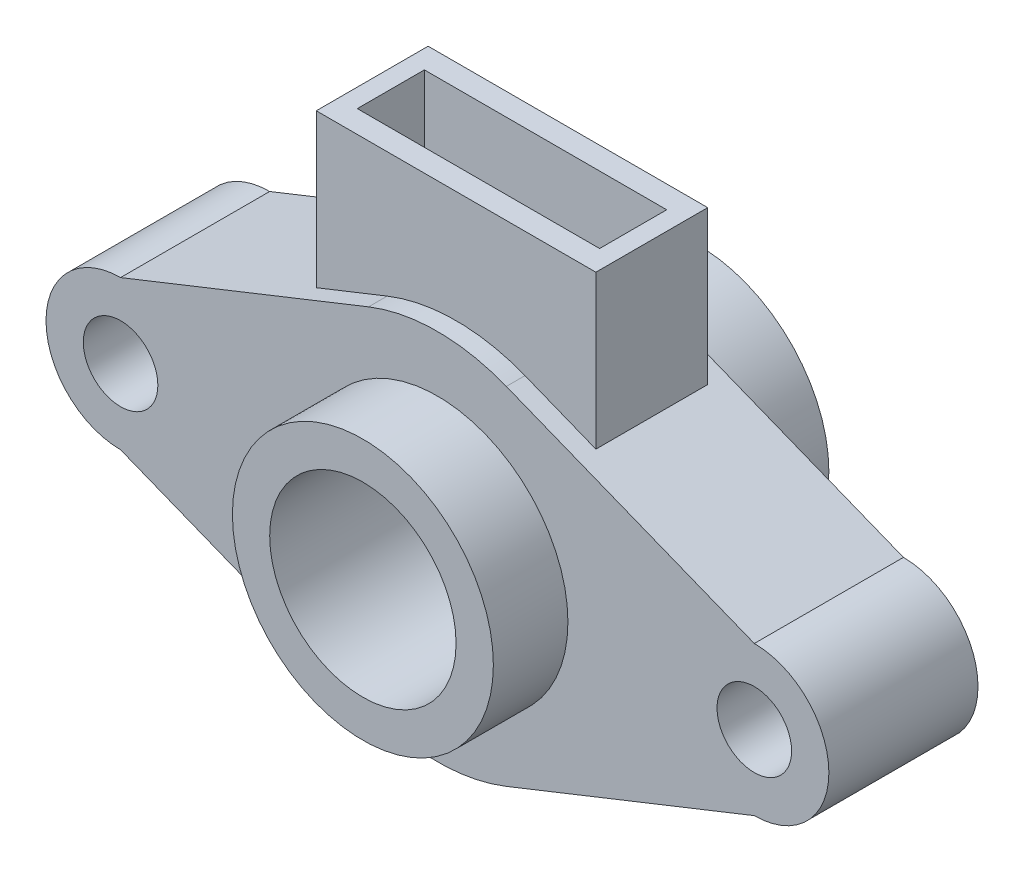
ISO-10303-21;
HEADER;
FILE_DESCRIPTION(('STEP AP214'),'2;1');
FILE_NAME('part.step','',(''),(''),'','','');
FILE_SCHEMA(('AUTOMOTIVE_DESIGN { 1 0 10303 214 1 1 1 1 }'));
ENDSEC;
DATA;
#1=APPLICATION_CONTEXT('core data for automotive mechanical design processes');
#2=APPLICATION_PROTOCOL_DEFINITION('international standard','automotive_design',2000,#1);
#3=PRODUCT_CONTEXT('',#1,'mechanical');
#4=PRODUCT('Part','Part','',(#3));
#5=PRODUCT_RELATED_PRODUCT_CATEGORY('part','',(#4));
#6=PRODUCT_DEFINITION_FORMATION('','',#4);
#7=PRODUCT_DEFINITION_CONTEXT('part definition',#1,'design');
#8=PRODUCT_DEFINITION('design','',#6,#7);
#9=PRODUCT_DEFINITION_SHAPE('','',#8);
#10=(LENGTH_UNIT() NAMED_UNIT(*) SI_UNIT(.MILLI.,.METRE.));
#11=(NAMED_UNIT(*) PLANE_ANGLE_UNIT() SI_UNIT($,.RADIAN.));
#12=(NAMED_UNIT(*) SI_UNIT($,.STERADIAN.) SOLID_ANGLE_UNIT());
#13=UNCERTAINTY_MEASURE_WITH_UNIT(LENGTH_MEASURE(1.E-05),#10,'distance_accuracy_value','');
#14=(GEOMETRIC_REPRESENTATION_CONTEXT(3) GLOBAL_UNCERTAINTY_ASSIGNED_CONTEXT((#13)) GLOBAL_UNIT_ASSIGNED_CONTEXT((#10,
#11,#12)) REPRESENTATION_CONTEXT('',''));
#15=CARTESIAN_POINT('',(0.,0.,0.));
#16=DIRECTION('',(0.,0.,1.));
#17=DIRECTION('',(1.,0.,0.));
#18=AXIS2_PLACEMENT_3D('',#15,#16,#17);
#19=CARTESIAN_POINT('',(0.,0.,20.));
#20=DIRECTION('',(0.,0.,-1.));
#21=DIRECTION('',(-1.,0.,0.));
#22=AXIS2_PLACEMENT_3D('',#19,#20,#21);
#23=CYLINDRICAL_SURFACE('',#22,50.);
#24=DIRECTION('',(0.,0.,-1.));
#25=VECTOR('',#24,1.);
#26=CARTESIAN_POINT('',(-18.4801173355565,46.4595013238849,20.));
#27=LINE('',#26,#25);
#28=CARTESIAN_POINT('',(-18.4801173355565,46.4595013238849,-15.));
#29=VERTEX_POINT('',#28);
#30=CARTESIAN_POINT('',(-18.4801173355565,46.4595013238849,-20.));
#31=VERTEX_POINT('',#30);
#32=EDGE_CURVE('E290',#29,#31,#27,.T.);
#33=ORIENTED_EDGE('',*,*,#32,.F.);
#34=CARTESIAN_POINT('',(0.,0.,-15.));
#35=DIRECTION('',(0.,0.,-1.));
#36=DIRECTION('',(-1.,0.,0.));
#37=AXIS2_PLACEMENT_3D('',#34,#35,#36);
#38=CIRCLE('',#37,50.);
#39=CARTESIAN_POINT('',(18.4801173355565,46.4595013238849,-15.));
#40=VERTEX_POINT('',#39);
#41=EDGE_CURVE('E199',#40,#29,#38,.F.);
#42=ORIENTED_EDGE('',*,*,#41,.F.);
#43=DIRECTION('',(0.,0.,-1.));
#44=VECTOR('',#43,1.);
#45=CARTESIAN_POINT('',(18.4801173355565,46.4595013238849,20.));
#46=LINE('',#45,#44);
#47=CARTESIAN_POINT('',(18.4801173355565,46.4595013238849,-20.));
#48=VERTEX_POINT('',#47);
#49=EDGE_CURVE('E294',#40,#48,#46,.T.);
#50=ORIENTED_EDGE('',*,*,#49,.T.);
#51=CARTESIAN_POINT('',(0.,0.,-20.));
#52=DIRECTION('',(0.,0.,1.));
#53=DIRECTION('',(1.,0.,0.));
#54=AXIS2_PLACEMENT_3D('',#51,#52,#53);
#55=CIRCLE('',#54,50.);
#56=EDGE_CURVE('E284',#48,#31,#55,.T.);
#57=ORIENTED_EDGE('',*,*,#56,.T.);
#58=EDGE_LOOP('',(#33,#42,#50,#57));
#59=FACE_BOUND('',#58,.T.);
#60=ADVANCED_FACE('F33',(#59),#23,.T.);
#61=CARTESIAN_POINT('',(-85.,0.,20.));
#62=DIRECTION('',(0.,0.,1.));
#63=DIRECTION('',(1.,0.,0.));
#64=AXIS2_PLACEMENT_3D('',#61,#62,#63);
#65=PLANE('',#64);
#66=CARTESIAN_POINT('',(0.,0.,20.));
#67=DIRECTION('',(0.,0.,1.));
#68=DIRECTION('',(1.,0.,0.));
#69=AXIS2_PLACEMENT_3D('',#66,#67,#68);
#70=CIRCLE('',#69,35.);
#71=CARTESIAN_POINT('',(35.,0.,20.));
#72=VERTEX_POINT('',#71);
#73=EDGE_CURVE('E233',#72,#72,#70,.T.);
#74=ORIENTED_EDGE('',*,*,#73,.F.);
#75=EDGE_LOOP('',(#74));
#76=FACE_BOUND('',#75,.T.);
#77=CARTESIAN_POINT('',(-85.,0.,20.));
#78=DIRECTION('',(0.,0.,1.));
#79=DIRECTION('',(1.,0.,0.));
#80=AXIS2_PLACEMENT_3D('',#77,#78,#79);
#81=CIRCLE('',#80,10.);
#82=CARTESIAN_POINT('',(-75.,0.,20.));
#83=VERTEX_POINT('',#82);
#84=EDGE_CURVE('E246',#83,#83,#81,.T.);
#85=ORIENTED_EDGE('',*,*,#84,.F.);
#86=EDGE_LOOP('',(#85));
#87=FACE_BOUND('',#86,.T.);
#88=CARTESIAN_POINT('',(-85.,0.,20.));
#89=DIRECTION('',(0.,0.,1.));
#90=DIRECTION('',(1.,0.,0.));
#91=AXIS2_PLACEMENT_3D('',#88,#89,#90);
#92=CIRCLE('',#91,20.);
#93=CARTESIAN_POINT('',(-85.,20.,20.));
#94=VERTEX_POINT('',#93);
#95=CARTESIAN_POINT('',(-85.,-20.,20.));
#96=VERTEX_POINT('',#95);
#97=EDGE_CURVE('E252',#94,#96,#92,.T.);
#98=ORIENTED_EDGE('',*,*,#97,.T.);
#99=DIRECTION('',(0.929190026477698,-0.36960234671113,0.));
#100=VECTOR('',#99,1.);
#101=CARTESIAN_POINT('',(-85.,-20.,20.));
#102=LINE('',#101,#100);
#103=CARTESIAN_POINT('',(-18.4801173355565,-46.4595013238849,20.));
#104=VERTEX_POINT('',#103);
#105=EDGE_CURVE('E255',#96,#104,#102,.T.);
#106=ORIENTED_EDGE('',*,*,#105,.T.);
#107=CARTESIAN_POINT('',(0.,0.,20.));
#108=DIRECTION('',(0.,0.,1.));
#109=DIRECTION('',(1.,0.,0.));
#110=AXIS2_PLACEMENT_3D('',#107,#108,#109);
#111=CIRCLE('',#110,50.);
#112=CARTESIAN_POINT('',(18.4801173355565,-46.4595013238849,20.));
#113=VERTEX_POINT('',#112);
#114=EDGE_CURVE('E258',#104,#113,#111,.T.);
#115=ORIENTED_EDGE('',*,*,#114,.T.);
#116=DIRECTION('',(0.929190026477698,0.36960234671113,0.));
#117=VECTOR('',#116,1.);
#118=CARTESIAN_POINT('',(85.,-20.,20.));
#119=LINE('',#118,#117);
#120=CARTESIAN_POINT('',(85.,-20.,20.));
#121=VERTEX_POINT('',#120);
#122=EDGE_CURVE('E260',#113,#121,#119,.T.);
#123=ORIENTED_EDGE('',*,*,#122,.T.);
#124=CARTESIAN_POINT('',(85.,0.,20.));
#125=DIRECTION('',(0.,0.,1.));
#126=DIRECTION('',(1.,0.,0.));
#127=AXIS2_PLACEMENT_3D('',#124,#125,#126);
#128=CIRCLE('',#127,20.);
#129=CARTESIAN_POINT('',(85.,20.,20.));
#130=VERTEX_POINT('',#129);
#131=EDGE_CURVE('E262',#121,#130,#128,.T.);
#132=ORIENTED_EDGE('',*,*,#131,.T.);
#133=DIRECTION('',(-0.929190026477698,0.36960234671113,0.));
#134=VECTOR('',#133,1.);
#135=CARTESIAN_POINT('',(85.,20.,20.));
#136=LINE('',#135,#134);
#137=CARTESIAN_POINT('',(18.4801173355565,46.4595013238849,20.));
#138=VERTEX_POINT('',#137);
#139=EDGE_CURVE('E264',#130,#138,#136,.T.);
#140=ORIENTED_EDGE('',*,*,#139,.T.);
#141=CARTESIAN_POINT('',(0.,0.,20.));
#142=DIRECTION('',(0.,0.,1.));
#143=DIRECTION('',(1.,0.,0.));
#144=AXIS2_PLACEMENT_3D('',#141,#142,#143);
#145=CIRCLE('',#144,50.);
#146=CARTESIAN_POINT('',(-18.4801173355565,46.4595013238849,20.));
#147=VERTEX_POINT('',#146);
#148=EDGE_CURVE('E266',#138,#147,#145,.T.);
#149=ORIENTED_EDGE('',*,*,#148,.T.);
#150=DIRECTION('',(-0.929190026477698,-0.36960234671113,0.));
#151=VECTOR('',#150,1.);
#152=CARTESIAN_POINT('',(-85.,20.,20.));
#153=LINE('',#152,#151);
#154=EDGE_CURVE('E268',#147,#94,#153,.T.);
#155=ORIENTED_EDGE('',*,*,#154,.T.);
#156=EDGE_LOOP('',(#98,#106,#115,#123,#132,#140,#149,#155));
#157=FACE_BOUND('',#156,.T.);
#158=CARTESIAN_POINT('',(85.,0.,20.));
#159=DIRECTION('',(0.,0.,1.));
#160=DIRECTION('',(1.,0.,0.));
#161=AXIS2_PLACEMENT_3D('',#158,#159,#160);
#162=CIRCLE('',#161,10.);
#163=CARTESIAN_POINT('',(95.,0.,20.));
#164=VERTEX_POINT('',#163);
#165=EDGE_CURVE('E240',#164,#164,#162,.T.);
#166=ORIENTED_EDGE('',*,*,#165,.F.);
#167=EDGE_LOOP('',(#166));
#168=FACE_BOUND('',#167,.T.);
#169=ADVANCED_FACE('F343',(#76,#87,#157,#168),#65,.T.);
#170=CARTESIAN_POINT('',(-85.,0.,-20.));
#171=DIRECTION('',(0.,0.,1.));
#172=DIRECTION('',(1.,0.,0.));
#173=AXIS2_PLACEMENT_3D('',#170,#171,#172);
#174=PLANE('',#173);
#175=CARTESIAN_POINT('',(0.,0.,-20.));
#176=DIRECTION('',(0.,0.,1.));
#177=DIRECTION('',(1.,0.,0.));
#178=AXIS2_PLACEMENT_3D('',#175,#176,#177);
#179=CIRCLE('',#178,35.);
#180=CARTESIAN_POINT('',(35.,0.,-20.));
#181=VERTEX_POINT('',#180);
#182=EDGE_CURVE('E313',#181,#181,#179,.F.);
#183=ORIENTED_EDGE('',*,*,#182,.F.);
#184=EDGE_LOOP('',(#183));
#185=FACE_BOUND('',#184,.T.);
#186=CARTESIAN_POINT('',(-85.,0.,-20.));
#187=DIRECTION('',(0.,0.,1.));
#188=DIRECTION('',(1.,0.,0.));
#189=AXIS2_PLACEMENT_3D('',#186,#187,#188);
#190=CIRCLE('',#189,20.);
#191=CARTESIAN_POINT('',(-85.,20.,-20.));
#192=VERTEX_POINT('',#191);
#193=CARTESIAN_POINT('',(-85.,-20.,-20.));
#194=VERTEX_POINT('',#193);
#195=EDGE_CURVE('E249',#192,#194,#190,.T.);
#196=ORIENTED_EDGE('',*,*,#195,.F.);
#197=DIRECTION('',(-0.929190026477698,-0.36960234671113,0.));
#198=VECTOR('',#197,1.);
#199=CARTESIAN_POINT('',(-85.,20.,-20.));
#200=LINE('',#199,#198);
#201=EDGE_CURVE('E256',#31,#192,#200,.T.);
#202=ORIENTED_EDGE('',*,*,#201,.F.);
#203=ORIENTED_EDGE('',*,*,#56,.F.);
#204=DIRECTION('',(-0.929190026477698,0.36960234671113,0.));
#205=VECTOR('',#204,1.);
#206=CARTESIAN_POINT('',(85.,20.,-20.));
#207=LINE('',#206,#205);
#208=CARTESIAN_POINT('',(85.,20.,-20.));
#209=VERTEX_POINT('',#208);
#210=EDGE_CURVE('E281',#209,#48,#207,.T.);
#211=ORIENTED_EDGE('',*,*,#210,.F.);
#212=CARTESIAN_POINT('',(85.,0.,-20.));
#213=DIRECTION('',(0.,0.,1.));
#214=DIRECTION('',(1.,0.,0.));
#215=AXIS2_PLACEMENT_3D('',#212,#213,#214);
#216=CIRCLE('',#215,20.);
#217=CARTESIAN_POINT('',(85.,-20.,-20.));
#218=VERTEX_POINT('',#217);
#219=EDGE_CURVE('E279',#218,#209,#216,.T.);
#220=ORIENTED_EDGE('',*,*,#219,.F.);
#221=DIRECTION('',(0.929190026477698,0.36960234671113,0.));
#222=VECTOR('',#221,1.);
#223=CARTESIAN_POINT('',(85.,-20.,-20.));
#224=LINE('',#223,#222);
#225=CARTESIAN_POINT('',(18.4801173355565,-46.4595013238849,-20.));
#226=VERTEX_POINT('',#225);
#227=EDGE_CURVE('E277',#226,#218,#224,.T.);
#228=ORIENTED_EDGE('',*,*,#227,.F.);
#229=CARTESIAN_POINT('',(0.,0.,-20.));
#230=DIRECTION('',(0.,0.,1.));
#231=DIRECTION('',(1.,0.,0.));
#232=AXIS2_PLACEMENT_3D('',#229,#230,#231);
#233=CIRCLE('',#232,50.);
#234=CARTESIAN_POINT('',(-18.4801173355565,-46.4595013238849,-20.));
#235=VERTEX_POINT('',#234);
#236=EDGE_CURVE('E275',#235,#226,#233,.T.);
#237=ORIENTED_EDGE('',*,*,#236,.F.);
#238=DIRECTION('',(0.929190026477698,-0.36960234671113,0.));
#239=VECTOR('',#238,1.);
#240=CARTESIAN_POINT('',(-85.,-20.,-20.));
#241=LINE('',#240,#239);
#242=EDGE_CURVE('E273',#194,#235,#241,.T.);
#243=ORIENTED_EDGE('',*,*,#242,.F.);
#244=EDGE_LOOP('',(#196,#202,#203,#211,#220,#228,#237,#243));
#245=FACE_BOUND('',#244,.T.);
#246=CARTESIAN_POINT('',(-85.,0.,-20.));
#247=DIRECTION('',(0.,0.,1.));
#248=DIRECTION('',(1.,0.,0.));
#249=AXIS2_PLACEMENT_3D('',#246,#247,#248);
#250=CIRCLE('',#249,10.);
#251=CARTESIAN_POINT('',(-75.,0.,-20.));
#252=VERTEX_POINT('',#251);
#253=EDGE_CURVE('E243',#252,#252,#250,.T.);
#254=ORIENTED_EDGE('',*,*,#253,.T.);
#255=EDGE_LOOP('',(#254));
#256=FACE_BOUND('',#255,.T.);
#257=CARTESIAN_POINT('',(85.,0.,-20.));
#258=DIRECTION('',(0.,0.,1.));
#259=DIRECTION('',(1.,0.,0.));
#260=AXIS2_PLACEMENT_3D('',#257,#258,#259);
#261=CIRCLE('',#260,10.);
#262=CARTESIAN_POINT('',(95.,0.,-20.));
#263=VERTEX_POINT('',#262);
#264=EDGE_CURVE('E237',#263,#263,#261,.T.);
#265=ORIENTED_EDGE('',*,*,#264,.T.);
#266=EDGE_LOOP('',(#265));
#267=FACE_BOUND('',#266,.T.);
#268=ADVANCED_FACE('F335',(#185,#245,#256,#267),#174,.F.);
#269=CARTESIAN_POINT('',(-85.,0.,20.));
#270=DIRECTION('',(0.,0.,-1.));
#271=DIRECTION('',(-1.,0.,0.));
#272=AXIS2_PLACEMENT_3D('',#269,#270,#271);
#273=CYLINDRICAL_SURFACE('',#272,20.);
#274=ORIENTED_EDGE('',*,*,#195,.T.);
#275=DIRECTION('',(0.,0.,-1.));
#276=VECTOR('',#275,1.);
#277=CARTESIAN_POINT('',(-85.,-20.,20.));
#278=LINE('',#277,#276);
#279=EDGE_CURVE('E310',#96,#194,#278,.T.);
#280=ORIENTED_EDGE('',*,*,#279,.F.);
#281=ORIENTED_EDGE('',*,*,#97,.F.);
#282=DIRECTION('',(0.,0.,-1.));
#283=VECTOR('',#282,1.);
#284=CARTESIAN_POINT('',(-85.,20.,20.));
#285=LINE('',#284,#283);
#286=EDGE_CURVE('E270',#94,#192,#285,.T.);
#287=ORIENTED_EDGE('',*,*,#286,.T.);
#288=EDGE_LOOP('',(#274,#280,#281,#287));
#289=FACE_BOUND('',#288,.T.);
#290=ADVANCED_FACE('F35',(#289),#273,.T.);
#291=CARTESIAN_POINT('',(-85.,-20.,20.));
#292=DIRECTION('',(0.36960234671113,0.929190026477698,0.));
#293=DIRECTION('',(-0.929190026477698,0.36960234671113,0.));
#294=AXIS2_PLACEMENT_3D('',#291,#292,#293);
#295=PLANE('',#294);
#296=ORIENTED_EDGE('',*,*,#242,.T.);
#297=DIRECTION('',(0.,0.,-1.));
#298=VECTOR('',#297,1.);
#299=CARTESIAN_POINT('',(-18.4801173355565,-46.4595013238849,20.));
#300=LINE('',#299,#298);
#301=EDGE_CURVE('E307',#104,#235,#300,.T.);
#302=ORIENTED_EDGE('',*,*,#301,.F.);
#303=ORIENTED_EDGE('',*,*,#105,.F.);
#304=ORIENTED_EDGE('',*,*,#279,.T.);
#305=EDGE_LOOP('',(#296,#302,#303,#304));
#306=FACE_BOUND('',#305,.T.);
#307=ADVANCED_FACE('F405',(#306),#295,.F.);
#308=CARTESIAN_POINT('',(0.,0.,20.));
#309=DIRECTION('',(0.,0.,-1.));
#310=DIRECTION('',(-1.,0.,0.));
#311=AXIS2_PLACEMENT_3D('',#308,#309,#310);
#312=CYLINDRICAL_SURFACE('',#311,50.);
#313=ORIENTED_EDGE('',*,*,#236,.T.);
#314=DIRECTION('',(0.,0.,-1.));
#315=VECTOR('',#314,1.);
#316=CARTESIAN_POINT('',(18.4801173355565,-46.4595013238849,20.));
#317=LINE('',#316,#315);
#318=EDGE_CURVE('E304',#113,#226,#317,.T.);
#319=ORIENTED_EDGE('',*,*,#318,.F.);
#320=ORIENTED_EDGE('',*,*,#114,.F.);
#321=ORIENTED_EDGE('',*,*,#301,.T.);
#322=EDGE_LOOP('',(#313,#319,#320,#321));
#323=FACE_BOUND('',#322,.T.);
#324=ADVANCED_FACE('F402',(#323),#312,.T.);
#325=CARTESIAN_POINT('',(85.,-20.,20.));
#326=DIRECTION('',(-0.36960234671113,0.929190026477698,0.));
#327=DIRECTION('',(-0.929190026477698,-0.36960234671113,0.));
#328=AXIS2_PLACEMENT_3D('',#325,#326,#327);
#329=PLANE('',#328);
#330=ORIENTED_EDGE('',*,*,#227,.T.);
#331=DIRECTION('',(0.,0.,-1.));
#332=VECTOR('',#331,1.);
#333=CARTESIAN_POINT('',(85.,-20.,20.));
#334=LINE('',#333,#332);
#335=EDGE_CURVE('E301',#121,#218,#334,.T.);
#336=ORIENTED_EDGE('',*,*,#335,.F.);
#337=ORIENTED_EDGE('',*,*,#122,.F.);
#338=ORIENTED_EDGE('',*,*,#318,.T.);
#339=EDGE_LOOP('',(#330,#336,#337,#338));
#340=FACE_BOUND('',#339,.T.);
#341=ADVANCED_FACE('F396',(#340),#329,.F.);
#342=CARTESIAN_POINT('',(85.,0.,20.));
#343=DIRECTION('',(0.,0.,-1.));
#344=DIRECTION('',(-1.,0.,0.));
#345=AXIS2_PLACEMENT_3D('',#342,#343,#344);
#346=CYLINDRICAL_SURFACE('',#345,20.);
#347=ORIENTED_EDGE('',*,*,#219,.T.);
#348=DIRECTION('',(0.,0.,-1.));
#349=VECTOR('',#348,1.);
#350=CARTESIAN_POINT('',(85.,20.,20.));
#351=LINE('',#350,#349);
#352=EDGE_CURVE('E298',#130,#209,#351,.T.);
#353=ORIENTED_EDGE('',*,*,#352,.F.);
#354=ORIENTED_EDGE('',*,*,#131,.F.);
#355=ORIENTED_EDGE('',*,*,#335,.T.);
#356=EDGE_LOOP('',(#347,#353,#354,#355));
#357=FACE_BOUND('',#356,.T.);
#358=ADVANCED_FACE('F392',(#357),#346,.T.);
#359=CARTESIAN_POINT('',(85.,20.,20.));
#360=DIRECTION('',(-0.36960234671113,-0.929190026477698,0.));
#361=DIRECTION('',(0.929190026477698,-0.36960234671113,0.));
#362=AXIS2_PLACEMENT_3D('',#359,#360,#361);
#363=PLANE('',#362);
#364=ORIENTED_EDGE('',*,*,#49,.F.);
#365=DIRECTION('',(0.929190026477698,-0.36960234671113,0.));
#366=VECTOR('',#365,1.);
#367=CARTESIAN_POINT('',(85.,20.,-15.));
#368=LINE('',#367,#366);
#369=CARTESIAN_POINT('',(37.5,38.8939947357474,-15.));
#370=VERTEX_POINT('',#369);
#371=EDGE_CURVE('E221',#40,#370,#368,.T.);
#372=ORIENTED_EDGE('',*,*,#371,.T.);
#373=DIRECTION('',(0.,0.,1.));
#374=VECTOR('',#373,1.);
#375=CARTESIAN_POINT('',(37.5,38.8939947357474,20.));
#376=LINE('',#375,#374);
#377=CARTESIAN_POINT('',(37.5,38.8939947357474,15.));
#378=VERTEX_POINT('',#377);
#379=EDGE_CURVE('E11',#370,#378,#376,.T.);
#380=ORIENTED_EDGE('',*,*,#379,.T.);
#381=DIRECTION('',(-0.929190026477698,0.36960234671113,0.));
#382=VECTOR('',#381,1.);
#383=CARTESIAN_POINT('',(85.,20.,15.));
#384=LINE('',#383,#382);
#385=CARTESIAN_POINT('',(18.4801173355565,46.4595013238849,15.));
#386=VERTEX_POINT('',#385);
#387=EDGE_CURVE('E215',#378,#386,#384,.T.);
#388=ORIENTED_EDGE('',*,*,#387,.T.);
#389=EDGE_CURVE('E295',#138,#386,#46,.T.);
#390=ORIENTED_EDGE('',*,*,#389,.F.);
#391=ORIENTED_EDGE('',*,*,#139,.F.);
#392=ORIENTED_EDGE('',*,*,#352,.T.);
#393=ORIENTED_EDGE('',*,*,#210,.T.);
#394=EDGE_LOOP('',(#364,#372,#380,#388,#390,#391,#392,#393));
#395=FACE_BOUND('',#394,.T.);
#396=ADVANCED_FACE('F355',(#395),#363,.F.);
#397=ORIENTED_EDGE('',*,*,#389,.T.);
#398=CARTESIAN_POINT('',(0.,0.,15.));
#399=DIRECTION('',(0.,0.,1.));
#400=DIRECTION('',(1.,0.,0.));
#401=AXIS2_PLACEMENT_3D('',#398,#399,#400);
#402=CIRCLE('',#401,50.);
#403=CARTESIAN_POINT('',(-18.4801173355565,46.4595013238849,15.));
#404=VERTEX_POINT('',#403);
#405=EDGE_CURVE('E210',#404,#386,#402,.F.);
#406=ORIENTED_EDGE('',*,*,#405,.F.);
#407=EDGE_CURVE('E291',#147,#404,#27,.T.);
#408=ORIENTED_EDGE('',*,*,#407,.F.);
#409=ORIENTED_EDGE('',*,*,#148,.F.);
#410=EDGE_LOOP('',(#397,#406,#408,#409));
#411=FACE_BOUND('',#410,.T.);
#412=ADVANCED_FACE('F350',(#411),#23,.T.);
#413=CARTESIAN_POINT('',(-85.,20.,20.));
#414=DIRECTION('',(0.36960234671113,-0.929190026477698,0.));
#415=DIRECTION('',(0.929190026477698,0.36960234671113,0.));
#416=AXIS2_PLACEMENT_3D('',#413,#414,#415);
#417=PLANE('',#416);
#418=DIRECTION('',(0.,0.,-1.));
#419=VECTOR('',#418,1.);
#420=CARTESIAN_POINT('',(-37.5,38.8939947357475,20.));
#421=LINE('',#420,#419);
#422=CARTESIAN_POINT('',(-37.5,38.8939947357475,15.));
#423=VERTEX_POINT('',#422);
#424=CARTESIAN_POINT('',(-37.5,38.8939947357475,-15.));
#425=VERTEX_POINT('',#424);
#426=EDGE_CURVE('E319',#423,#425,#421,.T.);
#427=ORIENTED_EDGE('',*,*,#426,.T.);
#428=DIRECTION('',(0.929190026477698,0.36960234671113,0.));
#429=VECTOR('',#428,1.);
#430=CARTESIAN_POINT('',(-85.,20.,-15.));
#431=LINE('',#430,#429);
#432=EDGE_CURVE('E41',#425,#29,#431,.T.);
#433=ORIENTED_EDGE('',*,*,#432,.T.);
#434=ORIENTED_EDGE('',*,*,#32,.T.);
#435=ORIENTED_EDGE('',*,*,#201,.T.);
#436=ORIENTED_EDGE('',*,*,#286,.F.);
#437=ORIENTED_EDGE('',*,*,#154,.F.);
#438=ORIENTED_EDGE('',*,*,#407,.T.);
#439=DIRECTION('',(-0.929190026477698,-0.36960234671113,0.));
#440=VECTOR('',#439,1.);
#441=CARTESIAN_POINT('',(-85.,20.,15.));
#442=LINE('',#441,#440);
#443=EDGE_CURVE('E316',#404,#423,#442,.T.);
#444=ORIENTED_EDGE('',*,*,#443,.T.);
#445=EDGE_LOOP('',(#427,#433,#434,#435,#436,#437,#438,#444));
#446=FACE_BOUND('',#445,.T.);
#447=ADVANCED_FACE('F324',(#446),#417,.F.);
#448=CARTESIAN_POINT('',(-85.,0.,20.));
#449=DIRECTION('',(0.,0.,-1.));
#450=DIRECTION('',(-1.,0.,0.));
#451=AXIS2_PLACEMENT_3D('',#448,#449,#450);
#452=CYLINDRICAL_SURFACE('',#451,10.);
#453=ORIENTED_EDGE('',*,*,#84,.T.);
#454=EDGE_LOOP('',(#453));
#455=FACE_BOUND('',#454,.T.);
#456=ORIENTED_EDGE('',*,*,#253,.F.);
#457=EDGE_LOOP('',(#456));
#458=FACE_BOUND('',#457,.T.);
#459=ADVANCED_FACE('F391',(#455,#458),#452,.F.);
#460=CARTESIAN_POINT('',(85.,0.,20.));
#461=DIRECTION('',(0.,0.,-1.));
#462=DIRECTION('',(-1.,0.,0.));
#463=AXIS2_PLACEMENT_3D('',#460,#461,#462);
#464=CYLINDRICAL_SURFACE('',#463,10.);
#465=ORIENTED_EDGE('',*,*,#165,.T.);
#466=EDGE_LOOP('',(#465));
#467=FACE_BOUND('',#466,.T.);
#468=ORIENTED_EDGE('',*,*,#264,.F.);
#469=EDGE_LOOP('',(#468));
#470=FACE_BOUND('',#469,.T.);
#471=ADVANCED_FACE('F432',(#467,#470),#464,.F.);
#472=CARTESIAN_POINT('',(0.,0.,40.));
#473=DIRECTION('',(0.,0.,1.));
#474=DIRECTION('',(1.,0.,0.));
#475=AXIS2_PLACEMENT_3D('',#472,#473,#474);
#476=PLANE('',#475);
#477=CARTESIAN_POINT('',(0.,0.,40.));
#478=DIRECTION('',(0.,0.,1.));
#479=DIRECTION('',(1.,0.,0.));
#480=AXIS2_PLACEMENT_3D('',#477,#478,#479);
#481=CIRCLE('',#480,35.);
#482=CARTESIAN_POINT('',(35.,0.,40.));
#483=VERTEX_POINT('',#482);
#484=EDGE_CURVE('E234',#483,#483,#481,.T.);
#485=ORIENTED_EDGE('',*,*,#484,.T.);
#486=EDGE_LOOP('',(#485));
#487=FACE_BOUND('',#486,.T.);
#488=CARTESIAN_POINT('',(0.,0.,40.));
#489=DIRECTION('',(0.,0.,1.));
#490=DIRECTION('',(1.,0.,0.));
#491=AXIS2_PLACEMENT_3D('',#488,#489,#490);
#492=CIRCLE('',#491,25.);
#493=CARTESIAN_POINT('',(25.,0.,40.));
#494=VERTEX_POINT('',#493);
#495=EDGE_CURVE('E230',#494,#494,#492,.T.);
#496=ORIENTED_EDGE('',*,*,#495,.F.);
#497=EDGE_LOOP('',(#496));
#498=FACE_BOUND('',#497,.T.);
#499=ADVANCED_FACE('F436',(#487,#498),#476,.T.);
#500=CARTESIAN_POINT('',(0.,0.,40.));
#501=DIRECTION('',(0.,0.,-1.));
#502=DIRECTION('',(-1.,0.,0.));
#503=AXIS2_PLACEMENT_3D('',#500,#501,#502);
#504=CYLINDRICAL_SURFACE('',#503,35.);
#505=ORIENTED_EDGE('',*,*,#484,.F.);
#506=EDGE_LOOP('',(#505));
#507=FACE_BOUND('',#506,.T.);
#508=ORIENTED_EDGE('',*,*,#73,.T.);
#509=EDGE_LOOP('',(#508));
#510=FACE_BOUND('',#509,.T.);
#511=ADVANCED_FACE('F438',(#507,#510),#504,.T.);
#512=CARTESIAN_POINT('',(0.,0.,40.));
#513=DIRECTION('',(0.,0.,-1.));
#514=DIRECTION('',(-1.,0.,0.));
#515=AXIS2_PLACEMENT_3D('',#512,#513,#514);
#516=CYLINDRICAL_SURFACE('',#515,25.);
#517=ORIENTED_EDGE('',*,*,#495,.T.);
#518=EDGE_LOOP('',(#517));
#519=FACE_BOUND('',#518,.T.);
#520=CARTESIAN_POINT('',(0.,0.,-50.));
#521=DIRECTION('',(0.,0.,-1.));
#522=DIRECTION('',(-1.,0.,0.));
#523=AXIS2_PLACEMENT_3D('',#520,#521,#522);
#524=CIRCLE('',#523,25.);
#525=CARTESIAN_POINT('',(-25.,0.,-50.));
#526=VERTEX_POINT('',#525);
#527=EDGE_CURVE('E224',#526,#526,#524,.T.);
#528=ORIENTED_EDGE('',*,*,#527,.T.);
#529=EDGE_LOOP('',(#528));
#530=FACE_BOUND('',#529,.T.);
#531=ADVANCED_FACE('F441',(#519,#530),#516,.F.);
#532=CARTESIAN_POINT('',(0.,0.,-50.));
#533=DIRECTION('',(0.,0.,-1.));
#534=DIRECTION('',(-1.,0.,0.));
#535=AXIS2_PLACEMENT_3D('',#532,#533,#534);
#536=PLANE('',#535);
#537=CARTESIAN_POINT('',(0.,0.,-50.));
#538=DIRECTION('',(0.,0.,-1.));
#539=DIRECTION('',(-1.,0.,0.));
#540=AXIS2_PLACEMENT_3D('',#537,#538,#539);
#541=CIRCLE('',#540,35.);
#542=CARTESIAN_POINT('',(-35.,0.,-50.));
#543=VERTEX_POINT('',#542);
#544=EDGE_CURVE('E227',#543,#543,#541,.T.);
#545=ORIENTED_EDGE('',*,*,#544,.T.);
#546=EDGE_LOOP('',(#545));
#547=FACE_BOUND('',#546,.T.);
#548=ORIENTED_EDGE('',*,*,#527,.F.);
#549=EDGE_LOOP('',(#548));
#550=FACE_BOUND('',#549,.T.);
#551=ADVANCED_FACE('F448',(#547,#550),#536,.T.);
#552=CARTESIAN_POINT('',(0.,0.,-50.));
#553=DIRECTION('',(0.,0.,1.));
#554=DIRECTION('',(1.,0.,0.));
#555=AXIS2_PLACEMENT_3D('',#552,#553,#554);
#556=CYLINDRICAL_SURFACE('',#555,35.);
#557=ORIENTED_EDGE('',*,*,#544,.F.);
#558=EDGE_LOOP('',(#557));
#559=FACE_BOUND('',#558,.T.);
#560=ORIENTED_EDGE('',*,*,#182,.T.);
#561=EDGE_LOOP('',(#560));
#562=FACE_BOUND('',#561,.T.);
#563=ADVANCED_FACE('F450',(#559,#562),#556,.T.);
#564=CARTESIAN_POINT('',(37.5,-50.001,-15.));
#565=DIRECTION('',(1.,0.,0.));
#566=DIRECTION('',(0.,0.,-1.));
#567=AXIS2_PLACEMENT_3D('',#564,#565,#566);
#568=PLANE('',#567);
#569=ORIENTED_EDGE('',*,*,#379,.F.);
#570=DIRECTION('',(0.,1.,0.));
#571=VECTOR('',#570,1.);
#572=CARTESIAN_POINT('',(37.5,-50.001,-15.));
#573=LINE('',#572,#571);
#574=CARTESIAN_POINT('',(37.5,80.,-15.));
#575=VERTEX_POINT('',#574);
#576=EDGE_CURVE('E213',#370,#575,#573,.T.);
#577=ORIENTED_EDGE('',*,*,#576,.T.);
#578=DIRECTION('',(0.,0.,-1.));
#579=VECTOR('',#578,1.);
#580=CARTESIAN_POINT('',(37.5,80.,-15.));
#581=LINE('',#580,#579);
#582=CARTESIAN_POINT('',(37.5,80.,15.));
#583=VERTEX_POINT('',#582);
#584=EDGE_CURVE('E192',#583,#575,#581,.T.);
#585=ORIENTED_EDGE('',*,*,#584,.F.);
#586=DIRECTION('',(0.,1.,0.));
#587=VECTOR('',#586,1.);
#588=CARTESIAN_POINT('',(37.5,-50.001,15.));
#589=LINE('',#588,#587);
#590=EDGE_CURVE('E212',#378,#583,#589,.T.);
#591=ORIENTED_EDGE('',*,*,#590,.F.);
#592=EDGE_LOOP('',(#569,#577,#585,#591));
#593=FACE_BOUND('',#592,.T.);
#594=ADVANCED_FACE('F359',(#593),#568,.T.);
#595=CARTESIAN_POINT('',(-37.5,-50.001,-15.));
#596=DIRECTION('',(0.,0.,-1.));
#597=DIRECTION('',(-1.,0.,0.));
#598=AXIS2_PLACEMENT_3D('',#595,#596,#597);
#599=PLANE('',#598);
#600=ORIENTED_EDGE('',*,*,#371,.F.);
#601=ORIENTED_EDGE('',*,*,#41,.T.);
#602=ORIENTED_EDGE('',*,*,#432,.F.);
#603=DIRECTION('',(0.,1.,0.));
#604=VECTOR('',#603,1.);
#605=CARTESIAN_POINT('',(-37.5,-50.001,-15.));
#606=LINE('',#605,#604);
#607=CARTESIAN_POINT('',(-37.5,80.,-15.));
#608=VERTEX_POINT('',#607);
#609=EDGE_CURVE('E209',#425,#608,#606,.T.);
#610=ORIENTED_EDGE('',*,*,#609,.T.);
#611=DIRECTION('',(-1.,0.,0.));
#612=VECTOR('',#611,1.);
#613=CARTESIAN_POINT('',(-37.5,80.,-15.));
#614=LINE('',#613,#612);
#615=EDGE_CURVE('E203',#575,#608,#614,.T.);
#616=ORIENTED_EDGE('',*,*,#615,.F.);
#617=ORIENTED_EDGE('',*,*,#576,.F.);
#618=EDGE_LOOP('',(#600,#601,#602,#610,#616,#617));
#619=FACE_BOUND('',#618,.T.);
#620=ADVANCED_FACE('F362',(#619),#599,.T.);
#621=CARTESIAN_POINT('',(-37.5,-50.001,-15.));
#622=DIRECTION('',(-1.,0.,0.));
#623=DIRECTION('',(0.,0.,1.));
#624=AXIS2_PLACEMENT_3D('',#621,#622,#623);
#625=PLANE('',#624);
#626=ORIENTED_EDGE('',*,*,#426,.F.);
#627=DIRECTION('',(0.,1.,0.));
#628=VECTOR('',#627,1.);
#629=CARTESIAN_POINT('',(-37.5,-50.001,15.));
#630=LINE('',#629,#628);
#631=CARTESIAN_POINT('',(-37.5,80.,15.));
#632=VERTEX_POINT('',#631);
#633=EDGE_CURVE('E56',#423,#632,#630,.T.);
#634=ORIENTED_EDGE('',*,*,#633,.T.);
#635=DIRECTION('',(0.,0.,1.));
#636=VECTOR('',#635,1.);
#637=CARTESIAN_POINT('',(-37.5,80.,-15.));
#638=LINE('',#637,#636);
#639=EDGE_CURVE('E200',#608,#632,#638,.T.);
#640=ORIENTED_EDGE('',*,*,#639,.F.);
#641=ORIENTED_EDGE('',*,*,#609,.F.);
#642=EDGE_LOOP('',(#626,#634,#640,#641));
#643=FACE_BOUND('',#642,.T.);
#644=ADVANCED_FACE('F367',(#643),#625,.T.);
#645=CARTESIAN_POINT('',(-37.5,-50.001,15.));
#646=DIRECTION('',(0.,0.,1.));
#647=DIRECTION('',(1.,0.,0.));
#648=AXIS2_PLACEMENT_3D('',#645,#646,#647);
#649=PLANE('',#648);
#650=ORIENTED_EDGE('',*,*,#387,.F.);
#651=ORIENTED_EDGE('',*,*,#590,.T.);
#652=DIRECTION('',(1.,0.,0.));
#653=VECTOR('',#652,1.);
#654=CARTESIAN_POINT('',(-37.5,80.,15.));
#655=LINE('',#654,#653);
#656=EDGE_CURVE('E196',#632,#583,#655,.T.);
#657=ORIENTED_EDGE('',*,*,#656,.F.);
#658=ORIENTED_EDGE('',*,*,#633,.F.);
#659=ORIENTED_EDGE('',*,*,#443,.F.);
#660=ORIENTED_EDGE('',*,*,#405,.T.);
#661=EDGE_LOOP('',(#650,#651,#657,#658,#659,#660));
#662=FACE_BOUND('',#661,.T.);
#663=ADVANCED_FACE('F352',(#662),#649,.T.);
#664=CARTESIAN_POINT('',(0.,80.,0.));
#665=DIRECTION('',(0.,1.,0.));
#666=DIRECTION('',(0.,0.,1.));
#667=AXIS2_PLACEMENT_3D('',#664,#665,#666);
#668=PLANE('',#667);
#669=DIRECTION('',(0.,0.,1.));
#670=VECTOR('',#669,1.);
#671=CARTESIAN_POINT('',(-32.5,80.,-9.));
#672=LINE('',#671,#670);
#673=CARTESIAN_POINT('',(-32.5,80.,-9.));
#674=VERTEX_POINT('',#673);
#675=CARTESIAN_POINT('',(-32.5,80.,9.));
#676=VERTEX_POINT('',#675);
#677=EDGE_CURVE('E48',#674,#676,#672,.T.);
#678=ORIENTED_EDGE('',*,*,#677,.F.);
#679=DIRECTION('',(1.,0.,0.));
#680=VECTOR('',#679,1.);
#681=CARTESIAN_POINT('',(-32.5,80.,-9.));
#682=LINE('',#681,#680);
#683=CARTESIAN_POINT('',(32.5,80.,-9.));
#684=VERTEX_POINT('',#683);
#685=EDGE_CURVE('E177',#674,#684,#682,.T.);
#686=ORIENTED_EDGE('',*,*,#685,.T.);
#687=DIRECTION('',(0.,0.,1.));
#688=VECTOR('',#687,1.);
#689=CARTESIAN_POINT('',(32.5,80.,-9.));
#690=LINE('',#689,#688);
#691=CARTESIAN_POINT('',(32.5,80.,9.));
#692=VERTEX_POINT('',#691);
#693=EDGE_CURVE('E180',#684,#692,#690,.T.);
#694=ORIENTED_EDGE('',*,*,#693,.T.);
#695=DIRECTION('',(1.,0.,0.));
#696=VECTOR('',#695,1.);
#697=CARTESIAN_POINT('',(-32.5,80.,9.));
#698=LINE('',#697,#696);
#699=EDGE_CURVE('E186',#676,#692,#698,.T.);
#700=ORIENTED_EDGE('',*,*,#699,.F.);
#701=EDGE_LOOP('',(#678,#686,#694,#700));
#702=FACE_BOUND('',#701,.T.);
#703=ORIENTED_EDGE('',*,*,#584,.T.);
#704=ORIENTED_EDGE('',*,*,#615,.T.);
#705=ORIENTED_EDGE('',*,*,#639,.T.);
#706=ORIENTED_EDGE('',*,*,#656,.T.);
#707=EDGE_LOOP('',(#703,#704,#705,#706));
#708=FACE_BOUND('',#707,.T.);
#709=ADVANCED_FACE('F365',(#702,#708),#668,.T.);
#710=CARTESIAN_POINT('',(-32.5,40.,-9.));
#711=DIRECTION('',(-1.,0.,0.));
#712=DIRECTION('',(0.,0.,1.));
#713=AXIS2_PLACEMENT_3D('',#710,#711,#712);
#714=PLANE('',#713);
#715=ORIENTED_EDGE('',*,*,#677,.T.);
#716=DIRECTION('',(0.,1.,0.));
#717=VECTOR('',#716,1.);
#718=CARTESIAN_POINT('',(-32.5,40.,9.));
#719=LINE('',#718,#717);
#720=CARTESIAN_POINT('',(-32.5,40.,9.));
#721=VERTEX_POINT('',#720);
#722=EDGE_CURVE('E156',#721,#676,#719,.T.);
#723=ORIENTED_EDGE('',*,*,#722,.F.);
#724=DIRECTION('',(0.,0.,1.));
#725=VECTOR('',#724,1.);
#726=CARTESIAN_POINT('',(-32.5,40.,-9.));
#727=LINE('',#726,#725);
#728=CARTESIAN_POINT('',(-32.5,40.,-9.));
#729=VERTEX_POINT('',#728);
#730=EDGE_CURVE('E160',#729,#721,#727,.T.);
#731=ORIENTED_EDGE('',*,*,#730,.F.);
#732=DIRECTION('',(0.,1.,0.));
#733=VECTOR('',#732,1.);
#734=CARTESIAN_POINT('',(-32.5,40.,-9.));
#735=LINE('',#734,#733);
#736=EDGE_CURVE('E190',#729,#674,#735,.T.);
#737=ORIENTED_EDGE('',*,*,#736,.T.);
#738=EDGE_LOOP('',(#715,#723,#731,#737));
#739=FACE_BOUND('',#738,.T.);
#740=ADVANCED_FACE('F158',(#739),#714,.F.);
#741=CARTESIAN_POINT('',(-32.5,40.,-9.));
#742=DIRECTION('',(0.,0.,1.));
#743=DIRECTION('',(1.,0.,0.));
#744=AXIS2_PLACEMENT_3D('',#741,#742,#743);
#745=PLANE('',#744);
#746=ORIENTED_EDGE('',*,*,#685,.F.);
#747=ORIENTED_EDGE('',*,*,#736,.F.);
#748=DIRECTION('',(1.,0.,0.));
#749=VECTOR('',#748,1.);
#750=CARTESIAN_POINT('',(-32.5,40.,-9.));
#751=LINE('',#750,#749);
#752=CARTESIAN_POINT('',(32.5,40.,-9.));
#753=VERTEX_POINT('',#752);
#754=EDGE_CURVE('E165',#729,#753,#751,.T.);
#755=ORIENTED_EDGE('',*,*,#754,.T.);
#756=DIRECTION('',(0.,1.,0.));
#757=VECTOR('',#756,1.);
#758=CARTESIAN_POINT('',(32.5,40.,-9.));
#759=LINE('',#758,#757);
#760=EDGE_CURVE('E193',#753,#684,#759,.T.);
#761=ORIENTED_EDGE('',*,*,#760,.T.);
#762=EDGE_LOOP('',(#746,#747,#755,#761));
#763=FACE_BOUND('',#762,.T.);
#764=ADVANCED_FACE('F494',(#763),#745,.T.);
#765=CARTESIAN_POINT('',(32.5,40.,-9.));
#766=DIRECTION('',(-1.,0.,0.));
#767=DIRECTION('',(0.,0.,1.));
#768=AXIS2_PLACEMENT_3D('',#765,#766,#767);
#769=PLANE('',#768);
#770=ORIENTED_EDGE('',*,*,#693,.F.);
#771=ORIENTED_EDGE('',*,*,#760,.F.);
#772=DIRECTION('',(0.,0.,1.));
#773=VECTOR('',#772,1.);
#774=CARTESIAN_POINT('',(32.5,40.,-9.));
#775=LINE('',#774,#773);
#776=CARTESIAN_POINT('',(32.5,40.,9.));
#777=VERTEX_POINT('',#776);
#778=EDGE_CURVE('E173',#753,#777,#775,.T.);
#779=ORIENTED_EDGE('',*,*,#778,.T.);
#780=DIRECTION('',(0.,1.,0.));
#781=VECTOR('',#780,1.);
#782=CARTESIAN_POINT('',(32.5,40.,9.));
#783=LINE('',#782,#781);
#784=EDGE_CURVE('E164',#777,#692,#783,.T.);
#785=ORIENTED_EDGE('',*,*,#784,.T.);
#786=EDGE_LOOP('',(#770,#771,#779,#785));
#787=FACE_BOUND('',#786,.T.);
#788=ADVANCED_FACE('F503',(#787),#769,.T.);
#789=CARTESIAN_POINT('',(-32.5,40.,9.));
#790=DIRECTION('',(0.,0.,1.));
#791=DIRECTION('',(1.,0.,0.));
#792=AXIS2_PLACEMENT_3D('',#789,#790,#791);
#793=PLANE('',#792);
#794=ORIENTED_EDGE('',*,*,#699,.T.);
#795=ORIENTED_EDGE('',*,*,#784,.F.);
#796=DIRECTION('',(1.,0.,0.));
#797=VECTOR('',#796,1.);
#798=CARTESIAN_POINT('',(-32.5,40.,9.));
#799=LINE('',#798,#797);
#800=EDGE_CURVE('E169',#721,#777,#799,.T.);
#801=ORIENTED_EDGE('',*,*,#800,.F.);
#802=ORIENTED_EDGE('',*,*,#722,.T.);
#803=EDGE_LOOP('',(#794,#795,#801,#802));
#804=FACE_BOUND('',#803,.T.);
#805=ADVANCED_FACE('F170',(#804),#793,.F.);
#806=CARTESIAN_POINT('',(0.,40.,0.));
#807=DIRECTION('',(0.,1.,0.));
#808=DIRECTION('',(0.,0.,1.));
#809=AXIS2_PLACEMENT_3D('',#806,#807,#808);
#810=PLANE('',#809);
#811=ORIENTED_EDGE('',*,*,#730,.T.);
#812=ORIENTED_EDGE('',*,*,#800,.T.);
#813=ORIENTED_EDGE('',*,*,#778,.F.);
#814=ORIENTED_EDGE('',*,*,#754,.F.);
#815=EDGE_LOOP('',(#811,#812,#813,#814));
#816=FACE_BOUND('',#815,.T.);
#817=ADVANCED_FACE('F176',(#816),#810,.T.);
#818=CLOSED_SHELL('',(#60,#169,#268,#290,#307,#324,#341,#358,#396,#412,#447,#459,#471,#499,#511,
#531,#551,#563,#594,#620,#644,#663,#709,#740,#764,#788,#805,#817));
#819=MANIFOLD_SOLID_BREP('B2',#818);
#820=ADVANCED_BREP_SHAPE_REPRESENTATION('',(#18,#819),#14);
#821=SHAPE_DEFINITION_REPRESENTATION(#9,#820);
ENDSEC;
END-ISO-10303-21;
